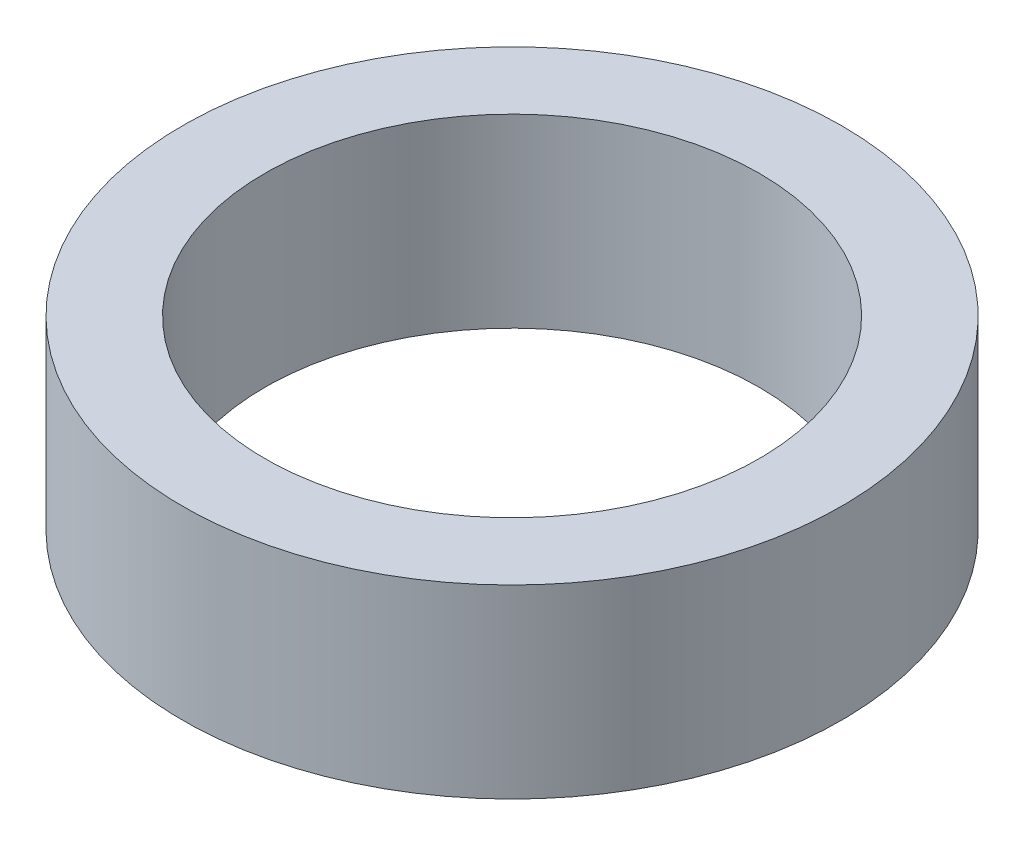
ISO-10303-21;
HEADER;
FILE_DESCRIPTION(('STEP AP214'),'2;1');
FILE_NAME('part.step','',(''),(''),'','','');
FILE_SCHEMA(('AUTOMOTIVE_DESIGN { 1 0 10303 214 1 1 1 1 }'));
ENDSEC;
DATA;
#1=APPLICATION_CONTEXT('core data for automotive mechanical design processes');
#2=APPLICATION_PROTOCOL_DEFINITION('international standard','automotive_design',2000,#1);
#3=PRODUCT_CONTEXT('',#1,'mechanical');
#4=PRODUCT('Part','Part','',(#3));
#5=PRODUCT_RELATED_PRODUCT_CATEGORY('part','',(#4));
#6=PRODUCT_DEFINITION_FORMATION('','',#4);
#7=PRODUCT_DEFINITION_CONTEXT('part definition',#1,'design');
#8=PRODUCT_DEFINITION('design','',#6,#7);
#9=PRODUCT_DEFINITION_SHAPE('','',#8);
#10=(LENGTH_UNIT() NAMED_UNIT(*) SI_UNIT(.MILLI.,.METRE.));
#11=(NAMED_UNIT(*) PLANE_ANGLE_UNIT() SI_UNIT($,.RADIAN.));
#12=(NAMED_UNIT(*) SI_UNIT($,.STERADIAN.) SOLID_ANGLE_UNIT());
#13=UNCERTAINTY_MEASURE_WITH_UNIT(LENGTH_MEASURE(1.E-05),#10,'distance_accuracy_value','');
#14=(GEOMETRIC_REPRESENTATION_CONTEXT(3) GLOBAL_UNCERTAINTY_ASSIGNED_CONTEXT((#13)) GLOBAL_UNIT_ASSIGNED_CONTEXT((#10,
#11,#12)) REPRESENTATION_CONTEXT('',''));
#15=CARTESIAN_POINT('',(0.,0.,0.));
#16=DIRECTION('',(0.,0.,1.));
#17=DIRECTION('',(1.,0.,0.));
#18=AXIS2_PLACEMENT_3D('',#15,#16,#17);
#19=CARTESIAN_POINT('',(0.,0.45,0.));
#20=DIRECTION('',(0.,-1.,0.));
#21=DIRECTION('',(0.,0.,-1.));
#22=AXIS2_PLACEMENT_3D('',#19,#20,#21);
#23=CYLINDRICAL_SURFACE('',#22,0.8);
#24=CARTESIAN_POINT('',(0.,0.45,0.));
#25=DIRECTION('',(0.,-1.,0.));
#26=DIRECTION('',(0.,0.,-1.));
#27=AXIS2_PLACEMENT_3D('',#24,#25,#26);
#28=CIRCLE('',#27,0.8);
#29=CARTESIAN_POINT('',(0.,0.45,-0.8));
#30=VERTEX_POINT('',#29);
#31=EDGE_CURVE('E10',#30,#30,#28,.T.);
#32=ORIENTED_EDGE('',*,*,#31,.T.);
#33=EDGE_LOOP('',(#32));
#34=FACE_BOUND('',#33,.T.);
#35=CARTESIAN_POINT('',(0.,0.,0.));
#36=DIRECTION('',(0.,-1.,0.));
#37=DIRECTION('',(0.,0.,-1.));
#38=AXIS2_PLACEMENT_3D('',#35,#36,#37);
#39=CIRCLE('',#38,0.8);
#40=CARTESIAN_POINT('',(0.,0.,-0.8));
#41=VERTEX_POINT('',#40);
#42=EDGE_CURVE('E44',#41,#41,#39,.T.);
#43=ORIENTED_EDGE('',*,*,#42,.F.);
#44=EDGE_LOOP('',(#43));
#45=FACE_BOUND('',#44,.T.);
#46=ADVANCED_FACE('F30',(#34,#45),#23,.T.);
#47=CARTESIAN_POINT('',(0.8,0.45,0.));
#48=DIRECTION('',(0.,1.,0.));
#49=DIRECTION('',(0.,0.,1.));
#50=AXIS2_PLACEMENT_3D('',#47,#48,#49);
#51=PLANE('',#50);
#52=CARTESIAN_POINT('',(0.,0.45,0.));
#53=DIRECTION('',(0.,-1.,0.));
#54=DIRECTION('',(0.,0.,-1.));
#55=AXIS2_PLACEMENT_3D('',#52,#53,#54);
#56=CIRCLE('',#55,0.6);
#57=CARTESIAN_POINT('',(0.,0.45,-0.6));
#58=VERTEX_POINT('',#57);
#59=EDGE_CURVE('E36',#58,#58,#56,.T.);
#60=ORIENTED_EDGE('',*,*,#59,.T.);
#61=EDGE_LOOP('',(#60));
#62=FACE_BOUND('',#61,.T.);
#63=ORIENTED_EDGE('',*,*,#31,.F.);
#64=EDGE_LOOP('',(#63));
#65=FACE_BOUND('',#64,.T.);
#66=ADVANCED_FACE('F54',(#62,#65),#51,.T.);
#67=CARTESIAN_POINT('',(0.,0.45,0.));
#68=DIRECTION('',(0.,-1.,0.));
#69=DIRECTION('',(0.,0.,-1.));
#70=AXIS2_PLACEMENT_3D('',#67,#68,#69);
#71=CYLINDRICAL_SURFACE('',#70,0.6);
#72=CARTESIAN_POINT('',(0.,0.,0.));
#73=DIRECTION('',(0.,-1.,0.));
#74=DIRECTION('',(0.,0.,-1.));
#75=AXIS2_PLACEMENT_3D('',#72,#73,#74);
#76=CIRCLE('',#75,0.6);
#77=CARTESIAN_POINT('',(0.,0.,-0.6));
#78=VERTEX_POINT('',#77);
#79=EDGE_CURVE('E40',#78,#78,#76,.T.);
#80=ORIENTED_EDGE('',*,*,#79,.T.);
#81=EDGE_LOOP('',(#80));
#82=FACE_BOUND('',#81,.T.);
#83=ORIENTED_EDGE('',*,*,#59,.F.);
#84=EDGE_LOOP('',(#83));
#85=FACE_BOUND('',#84,.T.);
#86=ADVANCED_FACE('F58',(#82,#85),#71,.F.);
#87=CARTESIAN_POINT('',(0.6,0.,0.));
#88=DIRECTION('',(0.,-1.,0.));
#89=DIRECTION('',(0.,0.,-1.));
#90=AXIS2_PLACEMENT_3D('',#87,#88,#89);
#91=PLANE('',#90);
#92=ORIENTED_EDGE('',*,*,#42,.T.);
#93=EDGE_LOOP('',(#92));
#94=FACE_BOUND('',#93,.T.);
#95=ORIENTED_EDGE('',*,*,#79,.F.);
#96=EDGE_LOOP('',(#95));
#97=FACE_BOUND('',#96,.T.);
#98=ADVANCED_FACE('F50',(#94,#97),#91,.T.);
#99=CLOSED_SHELL('',(#46,#66,#86,#98));
#100=MANIFOLD_SOLID_BREP('B2',#99);
#101=ADVANCED_BREP_SHAPE_REPRESENTATION('',(#18,#100),#14);
#102=SHAPE_DEFINITION_REPRESENTATION(#9,#101);
ENDSEC;
END-ISO-10303-21;
